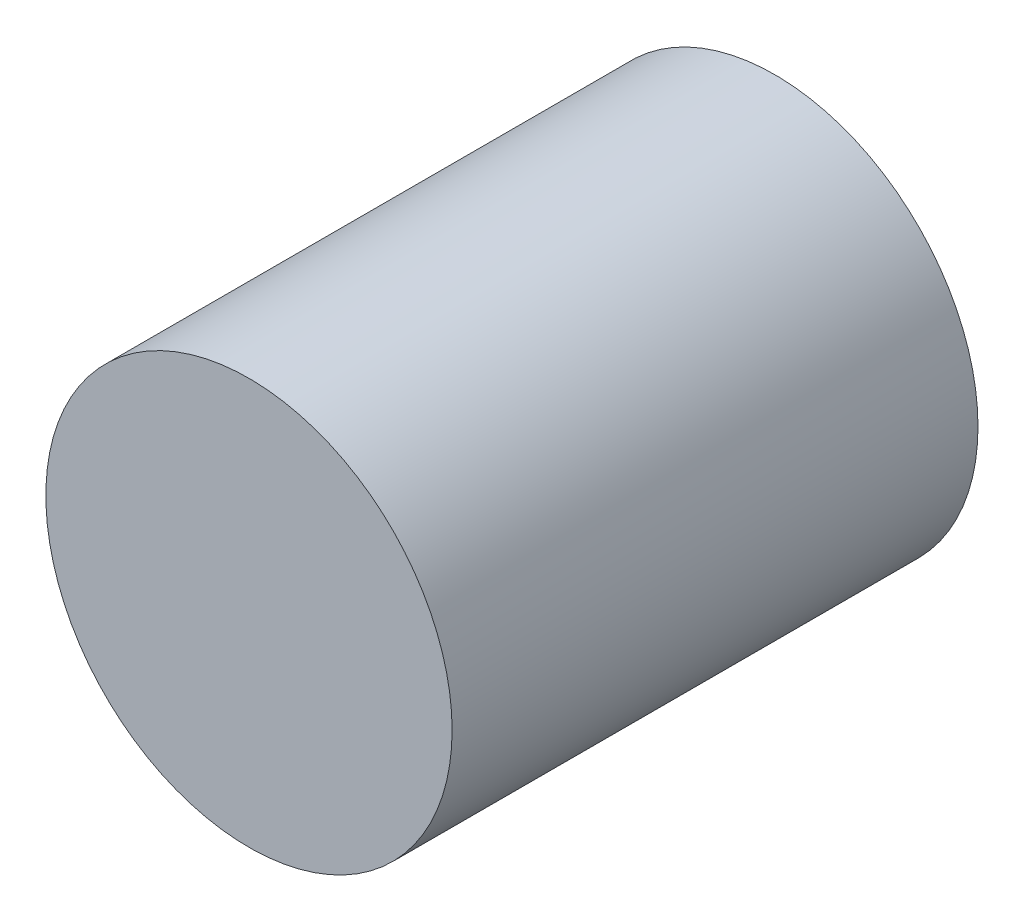
ISO-10303-21;
HEADER;
FILE_DESCRIPTION(('STEP AP214'),'2;1');
FILE_NAME('part.step','',(''),(''),'','','');
FILE_SCHEMA(('AUTOMOTIVE_DESIGN { 1 0 10303 214 1 1 1 1 }'));
ENDSEC;
DATA;
#1=APPLICATION_CONTEXT('core data for automotive mechanical design processes');
#2=APPLICATION_PROTOCOL_DEFINITION('international standard','automotive_design',2000,#1);
#3=PRODUCT_CONTEXT('',#1,'mechanical');
#4=PRODUCT('Part','Part','',(#3));
#5=PRODUCT_RELATED_PRODUCT_CATEGORY('part','',(#4));
#6=PRODUCT_DEFINITION_FORMATION('','',#4);
#7=PRODUCT_DEFINITION_CONTEXT('part definition',#1,'design');
#8=PRODUCT_DEFINITION('design','',#6,#7);
#9=PRODUCT_DEFINITION_SHAPE('','',#8);
#10=(LENGTH_UNIT() NAMED_UNIT(*) SI_UNIT(.MILLI.,.METRE.));
#11=(NAMED_UNIT(*) PLANE_ANGLE_UNIT() SI_UNIT($,.RADIAN.));
#12=(NAMED_UNIT(*) SI_UNIT($,.STERADIAN.) SOLID_ANGLE_UNIT());
#13=UNCERTAINTY_MEASURE_WITH_UNIT(LENGTH_MEASURE(1.E-05),#10,'distance_accuracy_value','');
#14=(GEOMETRIC_REPRESENTATION_CONTEXT(3) GLOBAL_UNCERTAINTY_ASSIGNED_CONTEXT((#13)) GLOBAL_UNIT_ASSIGNED_CONTEXT((#10,
#11,#12)) REPRESENTATION_CONTEXT('',''));
#15=CARTESIAN_POINT('',(0.,0.,0.));
#16=DIRECTION('',(0.,0.,1.));
#17=DIRECTION('',(1.,0.,0.));
#18=AXIS2_PLACEMENT_3D('',#15,#16,#17);
#19=CARTESIAN_POINT('',(0.,0.,2.9591));
#20=DIRECTION('',(0.,0.,-1.));
#21=DIRECTION('',(-1.,0.,0.));
#22=AXIS2_PLACEMENT_3D('',#19,#20,#21);
#23=CYLINDRICAL_SURFACE('',#22,1.143);
#24=CARTESIAN_POINT('',(0.,0.,2.9591));
#25=DIRECTION('',(0.,0.,1.));
#26=DIRECTION('',(1.,0.,0.));
#27=AXIS2_PLACEMENT_3D('',#24,#25,#26);
#28=CIRCLE('',#27,1.143);
#29=CARTESIAN_POINT('',(1.143,0.,2.9591));
#30=VERTEX_POINT('',#29);
#31=EDGE_CURVE('E10',#30,#30,#28,.T.);
#32=ORIENTED_EDGE('',*,*,#31,.F.);
#33=EDGE_LOOP('',(#32));
#34=FACE_BOUND('',#33,.T.);
#35=CARTESIAN_POINT('',(0.,0.,0.));
#36=DIRECTION('',(0.,0.,1.));
#37=DIRECTION('',(1.,0.,0.));
#38=AXIS2_PLACEMENT_3D('',#35,#36,#37);
#39=CIRCLE('',#38,1.143);
#40=CARTESIAN_POINT('',(1.143,0.,0.));
#41=VERTEX_POINT('',#40);
#42=EDGE_CURVE('E39',#41,#41,#39,.T.);
#43=ORIENTED_EDGE('',*,*,#42,.T.);
#44=EDGE_LOOP('',(#43));
#45=FACE_BOUND('',#44,.T.);
#46=ADVANCED_FACE('F36',(#34,#45),#23,.T.);
#47=CARTESIAN_POINT('',(0.,0.,2.9591));
#48=DIRECTION('',(0.,0.,1.));
#49=DIRECTION('',(1.,0.,0.));
#50=AXIS2_PLACEMENT_3D('',#47,#48,#49);
#51=PLANE('',#50);
#52=ORIENTED_EDGE('',*,*,#31,.T.);
#53=EDGE_LOOP('',(#52));
#54=FACE_BOUND('',#53,.T.);
#55=ADVANCED_FACE('F55',(#54),#51,.T.);
#56=CARTESIAN_POINT('',(0.,0.,0.));
#57=DIRECTION('',(0.,0.,1.));
#58=DIRECTION('',(1.,0.,0.));
#59=AXIS2_PLACEMENT_3D('',#56,#57,#58);
#60=PLANE('',#59);
#61=ORIENTED_EDGE('',*,*,#42,.F.);
#62=EDGE_LOOP('',(#61));
#63=FACE_BOUND('',#62,.T.);
#64=ADVANCED_FACE('F53',(#63),#60,.F.);
#65=CLOSED_SHELL('',(#46,#55,#64));
#66=MANIFOLD_SOLID_BREP('B2',#65);
#67=ADVANCED_BREP_SHAPE_REPRESENTATION('',(#18,#66),#14);
#68=SHAPE_DEFINITION_REPRESENTATION(#9,#67);
ENDSEC;
END-ISO-10303-21;
